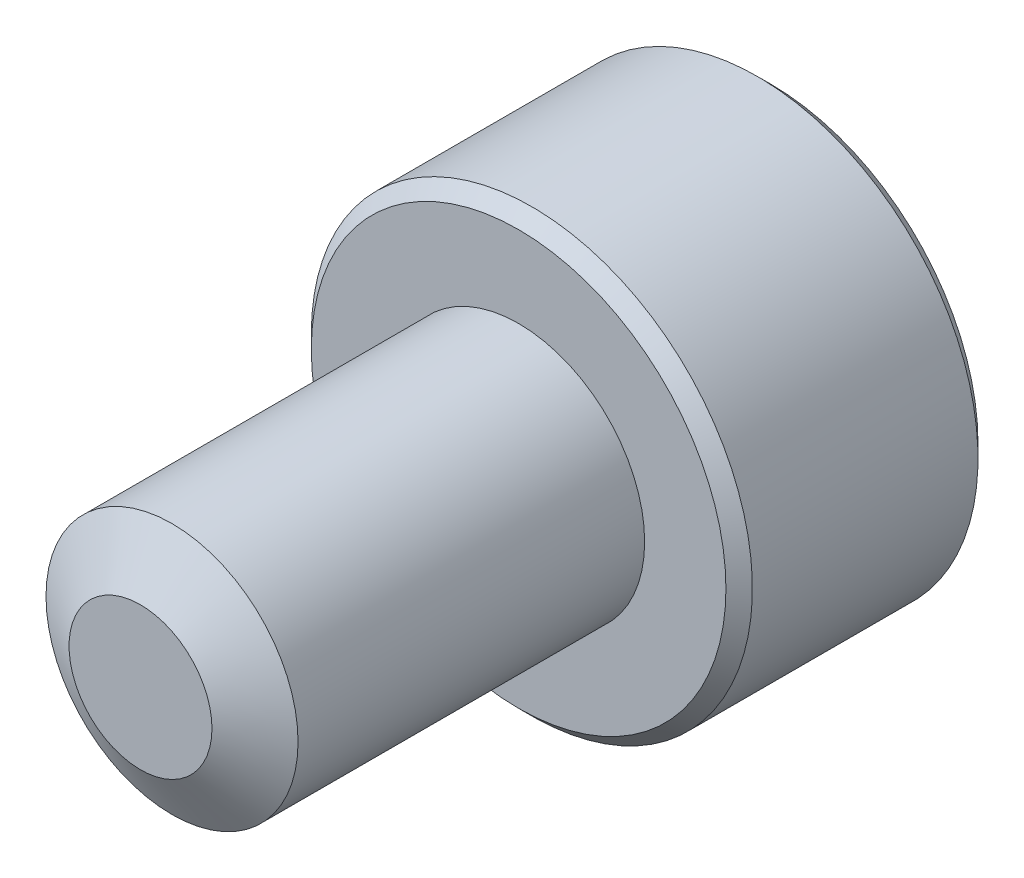
ISO-10303-21;
HEADER;
FILE_DESCRIPTION(('STEP AP214'),'2;1');
FILE_NAME('part.step','',(''),(''),'','','');
FILE_SCHEMA(('AUTOMOTIVE_DESIGN { 1 0 10303 214 1 1 1 1 }'));
ENDSEC;
DATA;
#1=APPLICATION_CONTEXT('core data for automotive mechanical design processes');
#2=APPLICATION_PROTOCOL_DEFINITION('international standard','automotive_design',2000,#1);
#3=PRODUCT_CONTEXT('',#1,'mechanical');
#4=PRODUCT('Part','Part','',(#3));
#5=PRODUCT_RELATED_PRODUCT_CATEGORY('part','',(#4));
#6=PRODUCT_DEFINITION_FORMATION('','',#4);
#7=PRODUCT_DEFINITION_CONTEXT('part definition',#1,'design');
#8=PRODUCT_DEFINITION('design','',#6,#7);
#9=PRODUCT_DEFINITION_SHAPE('','',#8);
#10=(LENGTH_UNIT() NAMED_UNIT(*) SI_UNIT(.MILLI.,.METRE.));
#11=(NAMED_UNIT(*) PLANE_ANGLE_UNIT() SI_UNIT($,.RADIAN.));
#12=(NAMED_UNIT(*) SI_UNIT($,.STERADIAN.) SOLID_ANGLE_UNIT());
#13=UNCERTAINTY_MEASURE_WITH_UNIT(LENGTH_MEASURE(1.E-05),#10,'distance_accuracy_value','');
#14=(GEOMETRIC_REPRESENTATION_CONTEXT(3) GLOBAL_UNCERTAINTY_ASSIGNED_CONTEXT((#13)) GLOBAL_UNIT_ASSIGNED_CONTEXT((#10,
#11,#12)) REPRESENTATION_CONTEXT('',''));
#15=CARTESIAN_POINT('',(0.,0.,0.));
#16=DIRECTION('',(0.,0.,1.));
#17=DIRECTION('',(1.,0.,0.));
#18=AXIS2_PLACEMENT_3D('',#15,#16,#17);
#19=CARTESIAN_POINT('',(0.,0.,-6.));
#20=DIRECTION('',(0.,0.,1.));
#21=DIRECTION('',(1.,0.,0.));
#22=AXIS2_PLACEMENT_3D('',#19,#20,#21);
#23=CYLINDRICAL_SURFACE('',#22,2.);
#24=CARTESIAN_POINT('',(0.,0.,-0.5));
#25=DIRECTION('',(0.,0.,1.));
#26=DIRECTION('',(1.,0.,0.));
#27=AXIS2_PLACEMENT_3D('',#24,#25,#26);
#28=CIRCLE('',#27,2.);
#29=CARTESIAN_POINT('',(2.,0.,-0.5));
#30=VERTEX_POINT('',#29);
#31=EDGE_CURVE('E11',#30,#30,#28,.F.);
#32=ORIENTED_EDGE('',*,*,#31,.T.);
#33=EDGE_LOOP('',(#32));
#34=FACE_BOUND('',#33,.T.);
#35=CARTESIAN_POINT('',(0.,0.,-6.));
#36=DIRECTION('',(0.,0.,1.));
#37=DIRECTION('',(1.,0.,0.));
#38=AXIS2_PLACEMENT_3D('',#35,#36,#37);
#39=CIRCLE('',#38,2.);
#40=CARTESIAN_POINT('',(2.,0.,-6.));
#41=VERTEX_POINT('',#40);
#42=EDGE_CURVE('E118',#41,#41,#39,.T.);
#43=ORIENTED_EDGE('',*,*,#42,.T.);
#44=EDGE_LOOP('',(#43));
#45=FACE_BOUND('',#44,.T.);
#46=ADVANCED_FACE('F41',(#34,#45),#23,.T.);
#47=CARTESIAN_POINT('',(0.,0.,-10.));
#48=DIRECTION('',(0.,0.,1.));
#49=DIRECTION('',(1.,0.,0.));
#50=AXIS2_PLACEMENT_3D('',#47,#48,#49);
#51=CYLINDRICAL_SURFACE('',#50,3.5);
#52=CARTESIAN_POINT('',(0.,0.,-9.79));
#53=DIRECTION('',(0.,0.,-1.));
#54=DIRECTION('',(-1.,0.,0.));
#55=AXIS2_PLACEMENT_3D('',#52,#53,#54);
#56=CIRCLE('',#55,3.5);
#57=CARTESIAN_POINT('',(-3.5,0.,-9.79));
#58=VERTEX_POINT('',#57);
#59=EDGE_CURVE('E190',#58,#58,#56,.F.);
#60=ORIENTED_EDGE('',*,*,#59,.T.);
#61=EDGE_LOOP('',(#60));
#62=FACE_BOUND('',#61,.T.);
#63=CARTESIAN_POINT('',(0.,0.,-6.21));
#64=DIRECTION('',(0.,0.,-1.));
#65=DIRECTION('',(-1.,0.,0.));
#66=AXIS2_PLACEMENT_3D('',#63,#64,#65);
#67=CIRCLE('',#66,3.5);
#68=CARTESIAN_POINT('',(-3.5,0.,-6.21));
#69=VERTEX_POINT('',#68);
#70=EDGE_CURVE('E186',#69,#69,#67,.T.);
#71=ORIENTED_EDGE('',*,*,#70,.T.);
#72=EDGE_LOOP('',(#71));
#73=FACE_BOUND('',#72,.T.);
#74=ADVANCED_FACE('F212',(#62,#73),#51,.T.);
#75=CARTESIAN_POINT('',(0.,0.,-10.));
#76=DIRECTION('',(0.,0.,-1.));
#77=DIRECTION('',(-1.,0.,0.));
#78=AXIS2_PLACEMENT_3D('',#75,#76,#77);
#79=PLANE('',#78);
#80=CARTESIAN_POINT('',(0.,0.,-10.));
#81=DIRECTION('',(0.,0.,-1.));
#82=DIRECTION('',(-1.,0.,0.));
#83=AXIS2_PLACEMENT_3D('',#80,#81,#82);
#84=CIRCLE('',#83,3.29);
#85=CARTESIAN_POINT('',(-3.29,0.,-10.));
#86=VERTEX_POINT('',#85);
#87=EDGE_CURVE('E117',#86,#86,#84,.T.);
#88=ORIENTED_EDGE('',*,*,#87,.T.);
#89=EDGE_LOOP('',(#88));
#90=FACE_BOUND('',#89,.T.);
#91=CARTESIAN_POINT('',(0.,0.,-10.));
#92=DIRECTION('',(0.,0.,-1.));
#93=DIRECTION('',(-1.,0.,0.));
#94=AXIS2_PLACEMENT_3D('',#91,#92,#93);
#95=CIRCLE('',#94,1.73205080756888);
#96=CARTESIAN_POINT('',(-1.5,0.866025403784442,-10.));
#97=VERTEX_POINT('',#96);
#98=CARTESIAN_POINT('',(0.,1.73205080756888,-10.));
#99=VERTEX_POINT('',#98);
#100=EDGE_CURVE('E96',#97,#99,#95,.T.);
#101=ORIENTED_EDGE('',*,*,#100,.F.);
#102=CARTESIAN_POINT('',(-1.5,-0.86602540378444,-10.));
#103=VERTEX_POINT('',#102);
#104=EDGE_CURVE('E56',#103,#97,#95,.T.);
#105=ORIENTED_EDGE('',*,*,#104,.F.);
#106=CARTESIAN_POINT('',(0.,-1.73205080756888,-10.));
#107=VERTEX_POINT('',#106);
#108=EDGE_CURVE('E313',#107,#103,#95,.T.);
#109=ORIENTED_EDGE('',*,*,#108,.F.);
#110=CARTESIAN_POINT('',(1.5,-0.866025403784441,-10.));
#111=VERTEX_POINT('',#110);
#112=EDGE_CURVE('E63',#111,#107,#95,.T.);
#113=ORIENTED_EDGE('',*,*,#112,.F.);
#114=CARTESIAN_POINT('',(1.5,0.866025403784441,-10.));
#115=VERTEX_POINT('',#114);
#116=EDGE_CURVE('E141',#115,#111,#95,.T.);
#117=ORIENTED_EDGE('',*,*,#116,.F.);
#118=EDGE_CURVE('E106',#99,#115,#95,.T.);
#119=ORIENTED_EDGE('',*,*,#118,.F.);
#120=EDGE_LOOP('',(#101,#105,#109,#113,#117,#119));
#121=FACE_BOUND('',#120,.T.);
#122=ADVANCED_FACE('F140',(#90,#121),#79,.T.);
#123=CARTESIAN_POINT('',(0.,0.,-6.));
#124=DIRECTION('',(0.,0.,-1.));
#125=DIRECTION('',(-1.,0.,0.));
#126=AXIS2_PLACEMENT_3D('',#123,#124,#125);
#127=PLANE('',#126);
#128=CARTESIAN_POINT('',(0.,0.,-6.));
#129=DIRECTION('',(0.,0.,-1.));
#130=DIRECTION('',(-1.,0.,0.));
#131=AXIS2_PLACEMENT_3D('',#128,#129,#130);
#132=CIRCLE('',#131,3.29);
#133=CARTESIAN_POINT('',(-3.29,0.,-6.));
#134=VERTEX_POINT('',#133);
#135=EDGE_CURVE('E194',#134,#134,#132,.F.);
#136=ORIENTED_EDGE('',*,*,#135,.T.);
#137=EDGE_LOOP('',(#136));
#138=FACE_BOUND('',#137,.T.);
#139=ORIENTED_EDGE('',*,*,#42,.F.);
#140=EDGE_LOOP('',(#139));
#141=FACE_BOUND('',#140,.T.);
#142=ADVANCED_FACE('F234',(#138,#141),#127,.F.);
#143=CARTESIAN_POINT('',(0.,0.,-10.));
#144=DIRECTION('',(0.,0.,-1.));
#145=DIRECTION('',(-1.,0.,0.));
#146=AXIS2_PLACEMENT_3D('',#143,#144,#145);
#147=CONICAL_SURFACE('',#146,1.73205080756888,0.78539816339745);
#148=ORIENTED_EDGE('',*,*,#118,.T.);
#149=CARTESIAN_POINT('',(-0.000199999999998815,1.73216627762271,-10.0001154816001));
#150=CARTESIAN_POINT('',(0.0513677907370769,1.70239359975915,-9.97036547606733));
#151=CARTESIAN_POINT('',(0.103797917665202,1.67212305186355,-9.94236248391031));
#152=CARTESIAN_POINT('',(0.210709034055598,1.61039789003619,-9.89108923044014));
#153=CARTESIAN_POINT('',(0.265200195814662,1.57893740312614,-9.86784750504437));
#154=CARTESIAN_POINT('',(0.375079081357249,1.51549879897987,-9.82803372899222));
#155=CARTESIAN_POINT('',(0.4304388090952,1.4835368452681,-9.8113615856709));
#156=CARTESIAN_POINT('',(0.542377257477151,1.41890915196211,-9.78567445681811));
#157=CARTESIAN_POINT('',(0.598952556553009,1.38624538781118,-9.77664029047887));
#158=CARTESIAN_POINT('',(0.696455389516441,1.329952100953,-9.76848908122685));
#159=CARTESIAN_POINT('',(0.737256908280466,1.30639533311124,-9.76728225298922));
#160=CARTESIAN_POINT('',(0.818787969615858,1.25932335290193,-9.76931405716227));
#161=CARTESIAN_POINT('',(0.85951749431463,1.23580815085313,-9.77255367074831));
#162=CARTESIAN_POINT('',(0.940584402163416,1.18900414978427,-9.78329198598196));
#163=CARTESIAN_POINT('',(0.980921384598288,1.1657155821172,-9.79079465301873));
#164=CARTESIAN_POINT('',(1.06091833691403,1.11952932016335,-9.80965161192829));
#165=CARTESIAN_POINT('',(1.10057800851621,1.09663179808786,-9.82100755701859));
#166=CARTESIAN_POINT('',(1.20216313477448,1.03798159809699,-9.85472164759267));
#167=CARTESIAN_POINT('',(1.26345855370969,1.00259267147465,-9.87962184909337));
#168=CARTESIAN_POINT('',(1.35358562846331,0.950557780604376,-9.92165665327158));
#169=CARTESIAN_POINT('',(1.38328513990772,0.933410759677149,-9.9364251535591));
#170=CARTESIAN_POINT('',(1.44213790138375,0.899432101996409,-9.96731056594017));
#171=CARTESIAN_POINT('',(1.47129140422064,0.882600319285711,-9.98342683412171));
#172=CARTESIAN_POINT('',(1.5002,0.865909933730602,-10.0001154816001));
#173=B_SPLINE_CURVE_WITH_KNOTS('',3,(#149,#150,#151,#152,#153,#154,#155,#156,#157,#158,#159,
#160,#161,#162,#163,#164,#165,#166,#167,#168,#169,#170,#171,#172),.UNSPECIFIED.,.F.,.F.,(4,2,2,
2,2,2,2,2,2,2,2,4),(0.,0.199829143693305,0.400822987382388,0.598623720538179,0.795926240188887,
0.937113067959879,1.07833105577193,1.21968061668222,1.36109089931054,1.58570969637565,
1.69770705470963,1.80965120737193),.UNSPECIFIED.);
#174=EDGE_CURVE('E111',#99,#115,#173,.T.);
#175=ORIENTED_EDGE('',*,*,#174,.F.);
#176=EDGE_LOOP('',(#148,#175));
#177=FACE_BOUND('',#176,.T.);
#178=ADVANCED_FACE('F112',(#177),#147,.F.);
#179=ORIENTED_EDGE('',*,*,#116,.T.);
#180=CARTESIAN_POINT('',(1.5,-1.72720812969692,-10.5555785162708));
#181=CARTESIAN_POINT('',(1.5,-1.68515175699268,-10.5238299078574));
#182=CARTESIAN_POINT('',(1.5,-1.64286104748673,-10.4923925938074));
#183=CARTESIAN_POINT('',(1.5,-1.55771581035942,-10.4302690875564));
#184=CARTESIAN_POINT('',(1.5,-1.51486114386668,-10.3995830858922));
#185=CARTESIAN_POINT('',(1.5,-1.3846813415127,-10.3084071924272));
#186=CARTESIAN_POINT('',(1.5,-1.29637976071653,-10.2492883434268));
#187=CARTESIAN_POINT('',(1.5,-1.11121478730467,-10.1332309963165));
#188=CARTESIAN_POINT('',(1.5,-1.01415038238167,-10.076609558733));
#189=CARTESIAN_POINT('',(1.5,-0.815173408897605,-9.97303688126565));
#190=CARTESIAN_POINT('',(1.5,-0.713278669253285,-9.92605304154167));
#191=CARTESIAN_POINT('',(1.5,-0.560333774943111,-9.86857266843083));
#192=CARTESIAN_POINT('',(1.5,-0.511547982948042,-9.85207538775725));
#193=CARTESIAN_POINT('',(1.5,-0.412798620136866,-9.822997512927));
#194=CARTESIAN_POINT('',(1.5,-0.362834968437562,-9.81041718859402));
#195=CARTESIAN_POINT('',(1.5,-0.262863235444982,-9.79003619414677));
#196=CARTESIAN_POINT('',(1.5,-0.212872113808023,-9.78215363274598));
#197=CARTESIAN_POINT('',(1.5,-0.112355243569546,-9.771322063969));
#198=CARTESIAN_POINT('',(1.5,-0.0618295883726282,-9.76837220852435));
#199=CARTESIAN_POINT('',(1.5,0.0374291733323835,-9.76762485772485));
#200=CARTESIAN_POINT('',(1.5,0.0861609672002982,-9.76964473355807));
#201=CARTESIAN_POINT('',(1.5,0.183206937768826,-9.77832255289676));
#202=CARTESIAN_POINT('',(1.5,0.231521073438268,-9.78498094696845));
#203=CARTESIAN_POINT('',(1.5,0.328199853425435,-9.80268524412257));
#204=CARTESIAN_POINT('',(1.5,0.376550616310327,-9.81380581125704));
#205=CARTESIAN_POINT('',(1.5,0.472195697125597,-9.83984341404871));
#206=CARTESIAN_POINT('',(1.5,0.519490103092739,-9.85476013204093));
#207=CARTESIAN_POINT('',(1.5,0.668391282696624,-9.90733522359607));
#208=CARTESIAN_POINT('',(1.5,0.767878709508551,-9.95098128747197));
#209=CARTESIAN_POINT('',(1.5,0.962179866690723,-10.0480229945931));
#210=CARTESIAN_POINT('',(1.5,1.05697519961444,-10.1014536650895));
#211=CARTESIAN_POINT('',(1.5,1.23814273533383,-10.2116858520046));
#212=CARTESIAN_POINT('',(1.5,1.32469942181289,-10.2681879206986));
#213=CARTESIAN_POINT('',(1.5,1.45222331290673,-10.3555343015787));
#214=CARTESIAN_POINT('',(1.5,1.49418091978755,-10.38495775868));
#215=CARTESIAN_POINT('',(1.5,1.57752272931476,-10.4445828218305));
#216=CARTESIAN_POINT('',(1.5,1.61890708647354,-10.4747842116644));
#217=CARTESIAN_POINT('',(1.5,1.66005278019494,-10.5053081786095));
#218=B_SPLINE_CURVE_WITH_KNOTS('',3,(#180,#181,#182,#183,#184,#185,#186,#187,#188,#189,#190,
#191,#192,#193,#194,#195,#196,#197,#198,#199,#200,#201,#202,#203,#204,#205,#206,#207,#208,#209,
#210,#211,#212,#213,#214,#215,#216,#217),.UNSPECIFIED.,.F.,.F.,(4,2,2,2,2,2,2,2,2,2,2,2,2,2,2,2,
2,2,4),(0.,0.158079548982669,0.316198780993942,0.634850417346958,0.971690311361509,
1.30737131660667,1.46173961127089,1.61611853740677,1.76772101421409,1.91929742368538,
2.065387412096,2.21149159305544,2.36014984633872,2.50879566386709,2.83376031422673,
3.15991186985652,3.46985601802197,3.62358896039973,3.7772796264207),.UNSPECIFIED.);
#219=EDGE_CURVE('E105',#115,#111,#218,.F.);
#220=ORIENTED_EDGE('',*,*,#219,.F.);
#221=EDGE_LOOP('',(#179,#220));
#222=FACE_BOUND('',#221,.T.);
#223=ADVANCED_FACE('F322',(#222),#147,.F.);
#224=ORIENTED_EDGE('',*,*,#112,.T.);
#225=CARTESIAN_POINT('',(1.5002,-0.865909933730601,-10.0001154816001));
#226=CARTESIAN_POINT('',(1.44863220926292,-0.895682611594166,-9.97036547606733));
#227=CARTESIAN_POINT('',(1.3962020823348,-0.925953159489765,-9.94236248391031));
#228=CARTESIAN_POINT('',(1.2892909659444,-0.987678321317123,-9.89108923044014));
#229=CARTESIAN_POINT('',(1.23479980418534,-1.01913880822717,-9.86784750504437));
#230=CARTESIAN_POINT('',(1.12492091864275,-1.08257741237344,-9.82803372899222));
#231=CARTESIAN_POINT('',(1.0695611909048,-1.11453936608521,-9.81136158567089));
#232=CARTESIAN_POINT('',(0.957622742522848,-1.1791670593912,-9.7856744568181));
#233=CARTESIAN_POINT('',(0.90104744344699,-1.21183082354213,-9.77664029047887));
#234=CARTESIAN_POINT('',(0.803544610483558,-1.26812411040032,-9.76848908122685));
#235=CARTESIAN_POINT('',(0.762743091719533,-1.29168087824208,-9.76728225298922));
#236=CARTESIAN_POINT('',(0.681212030384141,-1.33875285845138,-9.76931405716227));
#237=CARTESIAN_POINT('',(0.640482505685369,-1.36226806050018,-9.77255367074831));
#238=CARTESIAN_POINT('',(0.559415597836583,-1.40907206156905,-9.78329198598196));
#239=CARTESIAN_POINT('',(0.519078615401711,-1.43236062923612,-9.79079465301873));
#240=CARTESIAN_POINT('',(0.439081663085969,-1.47854689118996,-9.80965161192829));
#241=CARTESIAN_POINT('',(0.399421991483792,-1.50144441326545,-9.82100755701859));
#242=CARTESIAN_POINT('',(0.297836865225514,-1.56009461325633,-9.85472164759267));
#243=CARTESIAN_POINT('',(0.23654144629031,-1.59548353987866,-9.87962184909337));
#244=CARTESIAN_POINT('',(0.146414371536685,-1.64751843074894,-9.92165665327158));
#245=CARTESIAN_POINT('',(0.116714860092281,-1.66466545167617,-9.9364251535591));
#246=CARTESIAN_POINT('',(0.0578620986162475,-1.69864410935691,-9.96731056594017));
#247=CARTESIAN_POINT('',(0.0287085957793614,-1.71547589206761,-9.98342683412171));
#248=CARTESIAN_POINT('',(-0.000200000000001163,-1.73216627762271,-10.0001154816001));
#249=B_SPLINE_CURVE_WITH_KNOTS('',3,(#225,#226,#227,#228,#229,#230,#231,#232,#233,#234,#235,
#236,#237,#238,#239,#240,#241,#242,#243,#244,#245,#246,#247,#248),.UNSPECIFIED.,.F.,.F.,(4,2,2,
2,2,2,2,2,2,2,2,4),(0.,0.199829143693305,0.400822987382388,0.59862372053818,0.795926240188888,
0.93711306795988,1.07833105577193,1.21968061668222,1.36109089931054,1.58570969637565,
1.69770705470964,1.80965120737194),.UNSPECIFIED.);
#250=EDGE_CURVE('E154',#111,#107,#249,.T.);
#251=ORIENTED_EDGE('',*,*,#250,.F.);
#252=EDGE_LOOP('',(#224,#251));
#253=FACE_BOUND('',#252,.T.);
#254=ADVANCED_FACE('F320',(#253),#147,.F.);
#255=ORIENTED_EDGE('',*,*,#108,.T.);
#256=CARTESIAN_POINT('',(0.000199999999999467,-1.73216627762271,-10.0001154816001));
#257=CARTESIAN_POINT('',(-0.0513677907370766,-1.70239359975915,-9.97036547606733));
#258=CARTESIAN_POINT('',(-0.103797917665202,-1.67212305186355,-9.94236248391031));
#259=CARTESIAN_POINT('',(-0.210709034055597,-1.61039789003619,-9.89108923044014));
#260=CARTESIAN_POINT('',(-0.265200195814661,-1.57893740312614,-9.86784750504437));
#261=CARTESIAN_POINT('',(-0.375079081357249,-1.51549879897987,-9.82803372899222));
#262=CARTESIAN_POINT('',(-0.4304388090952,-1.4835368452681,-9.8113615856709));
#263=CARTESIAN_POINT('',(-0.542377257477151,-1.41890915196211,-9.78567445681811));
#264=CARTESIAN_POINT('',(-0.598952556553009,-1.38624538781118,-9.77664029047887));
#265=CARTESIAN_POINT('',(-0.696455389516441,-1.32995210095299,-9.76848908122685));
#266=CARTESIAN_POINT('',(-0.737256908280467,-1.30639533311124,-9.76728225298922));
#267=CARTESIAN_POINT('',(-0.818787969615859,-1.25932335290193,-9.76931405716227));
#268=CARTESIAN_POINT('',(-0.85951749431463,-1.23580815085313,-9.77255367074831));
#269=CARTESIAN_POINT('',(-0.940584402163416,-1.18900414978427,-9.78329198598196));
#270=CARTESIAN_POINT('',(-0.980921384598289,-1.1657155821172,-9.79079465301873));
#271=CARTESIAN_POINT('',(-1.06091833691403,-1.11952932016335,-9.80965161192829));
#272=CARTESIAN_POINT('',(-1.10057800851621,-1.09663179808786,-9.82100755701859));
#273=CARTESIAN_POINT('',(-1.20216313477449,-1.03798159809698,-9.85472164759267));
#274=CARTESIAN_POINT('',(-1.26345855370969,-1.00259267147465,-9.87962184909337));
#275=CARTESIAN_POINT('',(-1.35358562846331,-0.950557780604376,-9.92165665327158));
#276=CARTESIAN_POINT('',(-1.38328513990772,-0.933410759677149,-9.9364251535591));
#277=CARTESIAN_POINT('',(-1.44213790138375,-0.899432101996408,-9.96731056594017));
#278=CARTESIAN_POINT('',(-1.47129140422064,-0.882600319285712,-9.98342683412171));
#279=CARTESIAN_POINT('',(-1.5002,-0.865909933730603,-10.0001154816001));
#280=B_SPLINE_CURVE_WITH_KNOTS('',3,(#256,#257,#258,#259,#260,#261,#262,#263,#264,#265,#266,
#267,#268,#269,#270,#271,#272,#273,#274,#275,#276,#277,#278,#279),.UNSPECIFIED.,.F.,.F.,(4,2,2,
2,2,2,2,2,2,2,2,4),(0.,0.199829143693305,0.400822987382389,0.598623720538181,0.795926240188889,
0.937113067959881,1.07833105577193,1.21968061668222,1.36109089931055,1.58570969637565,
1.69770705470963,1.80965120737193),.UNSPECIFIED.);
#281=EDGE_CURVE('E285',#107,#103,#280,.T.);
#282=ORIENTED_EDGE('',*,*,#281,.F.);
#283=EDGE_LOOP('',(#255,#282));
#284=FACE_BOUND('',#283,.T.);
#285=ADVANCED_FACE('F318',(#284),#147,.F.);
#286=ORIENTED_EDGE('',*,*,#104,.T.);
#287=CARTESIAN_POINT('',(-1.5,-1.72720812969693,-10.5555785162708));
#288=CARTESIAN_POINT('',(-1.5,-1.68515175699268,-10.5238299078574));
#289=CARTESIAN_POINT('',(-1.5,-1.64286104748674,-10.4923925938074));
#290=CARTESIAN_POINT('',(-1.5,-1.55771581035942,-10.4302690875564));
#291=CARTESIAN_POINT('',(-1.5,-1.51486114386669,-10.3995830858922));
#292=CARTESIAN_POINT('',(-1.5,-1.38468134151271,-10.3084071924272));
#293=CARTESIAN_POINT('',(-1.5,-1.29637976071654,-10.2492883434268));
#294=CARTESIAN_POINT('',(-1.5,-1.11121478730467,-10.1332309963165));
#295=CARTESIAN_POINT('',(-1.5,-1.01415038238167,-10.076609558733));
#296=CARTESIAN_POINT('',(-1.5,-0.815173408897606,-9.97303688126565));
#297=CARTESIAN_POINT('',(-1.5,-0.713278669253286,-9.92605304154167));
#298=CARTESIAN_POINT('',(-1.5,-0.560333774943113,-9.86857266843083));
#299=CARTESIAN_POINT('',(-1.5,-0.511547982948043,-9.85207538775725));
#300=CARTESIAN_POINT('',(-1.5,-0.412798620136868,-9.822997512927));
#301=CARTESIAN_POINT('',(-1.5,-0.362834968437564,-9.81041718859402));
#302=CARTESIAN_POINT('',(-1.5,-0.262863235444984,-9.79003619414677));
#303=CARTESIAN_POINT('',(-1.5,-0.212872113808024,-9.78215363274598));
#304=CARTESIAN_POINT('',(-1.5,-0.112355243569547,-9.771322063969));
#305=CARTESIAN_POINT('',(-1.5,-0.0618295883726296,-9.76837220852435));
#306=CARTESIAN_POINT('',(-1.5,0.0374291733323826,-9.76762485772485));
#307=CARTESIAN_POINT('',(-1.5,0.0861609672002977,-9.76964473355807));
#308=CARTESIAN_POINT('',(-1.5,0.183206937768826,-9.77832255289676));
#309=CARTESIAN_POINT('',(-1.5,0.231521073438268,-9.78498094696845));
#310=CARTESIAN_POINT('',(-1.5,0.328199853425435,-9.80268524412257));
#311=CARTESIAN_POINT('',(-1.5,0.376550616310327,-9.81380581125704));
#312=CARTESIAN_POINT('',(-1.5,0.472195697125598,-9.83984341404871));
#313=CARTESIAN_POINT('',(-1.5,0.51949010309274,-9.85476013204093));
#314=CARTESIAN_POINT('',(-1.5,0.668391282696624,-9.90733522359607));
#315=CARTESIAN_POINT('',(-1.5,0.767878709508552,-9.95098128747197));
#316=CARTESIAN_POINT('',(-1.5,0.962179866690723,-10.0480229945931));
#317=CARTESIAN_POINT('',(-1.5,1.05697519961444,-10.1014536650895));
#318=CARTESIAN_POINT('',(-1.5,1.23814273533382,-10.2116858520046));
#319=CARTESIAN_POINT('',(-1.5,1.32469942181289,-10.2681879206986));
#320=CARTESIAN_POINT('',(-1.5,1.45222331290673,-10.3555343015787));
#321=CARTESIAN_POINT('',(-1.5,1.49418091978755,-10.38495775868));
#322=CARTESIAN_POINT('',(-1.5,1.57752272931476,-10.4445828218305));
#323=CARTESIAN_POINT('',(-1.5,1.61890708647354,-10.4747842116644));
#324=CARTESIAN_POINT('',(-1.5,1.66005278019494,-10.5053081786095));
#325=B_SPLINE_CURVE_WITH_KNOTS('',3,(#287,#288,#289,#290,#291,#292,#293,#294,#295,#296,#297,
#298,#299,#300,#301,#302,#303,#304,#305,#306,#307,#308,#309,#310,#311,#312,#313,#314,#315,#316,
#317,#318,#319,#320,#321,#322,#323,#324),.UNSPECIFIED.,.F.,.F.,(4,2,2,2,2,2,2,2,2,2,2,2,2,2,2,2,
2,2,4),(0.,0.15807954898267,0.316198780993944,0.634850417346961,0.971690311361516,
1.30737131660667,1.46173961127089,1.61611853740678,1.7677210142141,1.91929742368539,
2.06538741209601,2.21149159305545,2.36014984633873,2.5087956638671,2.83376031422674,
3.15991186985652,3.46985601802198,3.62358896039974,3.77727962642071),.UNSPECIFIED.);
#326=EDGE_CURVE('E129',#103,#97,#325,.T.);
#327=ORIENTED_EDGE('',*,*,#326,.F.);
#328=EDGE_LOOP('',(#286,#327));
#329=FACE_BOUND('',#328,.T.);
#330=ADVANCED_FACE('F327',(#329),#147,.F.);
#331=ORIENTED_EDGE('',*,*,#100,.T.);
#332=CARTESIAN_POINT('',(-1.5002,0.865909933730602,-10.0001154816001));
#333=CARTESIAN_POINT('',(-1.44863220926292,0.895682611594166,-9.97036547606733));
#334=CARTESIAN_POINT('',(-1.3962020823348,0.925953159489766,-9.94236248391031));
#335=CARTESIAN_POINT('',(-1.2892909659444,0.987678321317124,-9.89108923044014));
#336=CARTESIAN_POINT('',(-1.23479980418534,1.01913880822718,-9.86784750504437));
#337=CARTESIAN_POINT('',(-1.12492091864275,1.08257741237344,-9.82803372899222));
#338=CARTESIAN_POINT('',(-1.0695611909048,1.11453936608521,-9.81136158567089));
#339=CARTESIAN_POINT('',(-0.957622742522848,1.1791670593912,-9.7856744568181));
#340=CARTESIAN_POINT('',(-0.90104744344699,1.21183082354213,-9.77664029047887));
#341=CARTESIAN_POINT('',(-0.803544610483558,1.26812411040032,-9.76848908122685));
#342=CARTESIAN_POINT('',(-0.762743091719532,1.29168087824208,-9.76728225298922));
#343=CARTESIAN_POINT('',(-0.68121203038414,1.33875285845138,-9.76931405716227));
#344=CARTESIAN_POINT('',(-0.640482505685369,1.36226806050018,-9.77255367074831));
#345=CARTESIAN_POINT('',(-0.559415597836583,1.40907206156905,-9.78329198598196));
#346=CARTESIAN_POINT('',(-0.519078615401711,1.43236062923612,-9.79079465301873));
#347=CARTESIAN_POINT('',(-0.439081663085968,1.47854689118996,-9.80965161192829));
#348=CARTESIAN_POINT('',(-0.399421991483791,1.50144441326545,-9.82100755701859));
#349=CARTESIAN_POINT('',(-0.297836865225514,1.56009461325633,-9.85472164759267));
#350=CARTESIAN_POINT('',(-0.23654144629031,1.59548353987866,-9.87962184909337));
#351=CARTESIAN_POINT('',(-0.146414371536685,1.64751843074894,-9.92165665327158));
#352=CARTESIAN_POINT('',(-0.116714860092281,1.66466545167617,-9.9364251535591));
#353=CARTESIAN_POINT('',(-0.0578620986162474,1.69864410935691,-9.96731056594017));
#354=CARTESIAN_POINT('',(-0.0287085957793612,1.71547589206761,-9.98342683412171));
#355=CARTESIAN_POINT('',(0.000200000000001217,1.73216627762271,-10.0001154816001));
#356=B_SPLINE_CURVE_WITH_KNOTS('',3,(#332,#333,#334,#335,#336,#337,#338,#339,#340,#341,#342,
#343,#344,#345,#346,#347,#348,#349,#350,#351,#352,#353,#354,#355),.UNSPECIFIED.,.F.,.F.,(4,2,2,
2,2,2,2,2,2,2,2,4),(0.,0.199829143693304,0.400822987382388,0.59862372053818,0.795926240188888,
0.93711306795988,1.07833105577193,1.21968061668222,1.36109089931054,1.58570969637565,
1.69770705470963,1.80965120737194),.UNSPECIFIED.);
#357=EDGE_CURVE('E100',#97,#99,#356,.T.);
#358=ORIENTED_EDGE('',*,*,#357,.F.);
#359=EDGE_LOOP('',(#331,#358));
#360=FACE_BOUND('',#359,.T.);
#361=ADVANCED_FACE('F98',(#360),#147,.F.);
#362=CARTESIAN_POINT('',(1.5,2.59807621135331,-7.75));
#363=DIRECTION('',(0.,0.,-1.));
#364=DIRECTION('',(-1.,0.,0.));
#365=AXIS2_PLACEMENT_3D('',#362,#363,#364);
#366=PLANE('',#365);
#367=DIRECTION('',(0.866025403784439,0.5,0.));
#368=VECTOR('',#367,1.);
#369=CARTESIAN_POINT('',(-1.5,0.86602540378444,-7.75));
#370=LINE('',#369,#368);
#371=CARTESIAN_POINT('',(-1.5,0.86602540378444,-7.75));
#372=VERTEX_POINT('',#371);
#373=CARTESIAN_POINT('',(0.,1.73205080756888,-7.75));
#374=VERTEX_POINT('',#373);
#375=EDGE_CURVE('E128',#372,#374,#370,.T.);
#376=ORIENTED_EDGE('',*,*,#375,.T.);
#377=DIRECTION('',(0.866025403784439,-0.5,0.));
#378=VECTOR('',#377,1.);
#379=CARTESIAN_POINT('',(0.,1.73205080756888,-7.75));
#380=LINE('',#379,#378);
#381=CARTESIAN_POINT('',(1.5,0.86602540378444,-7.75));
#382=VERTEX_POINT('',#381);
#383=EDGE_CURVE('E133',#374,#382,#380,.T.);
#384=ORIENTED_EDGE('',*,*,#383,.T.);
#385=DIRECTION('',(0.,-1.,0.));
#386=VECTOR('',#385,1.);
#387=CARTESIAN_POINT('',(1.5,0.86602540378444,-7.75));
#388=LINE('',#387,#386);
#389=CARTESIAN_POINT('',(1.5,-0.866025403784439,-7.75));
#390=VERTEX_POINT('',#389);
#391=EDGE_CURVE('E260',#382,#390,#388,.T.);
#392=ORIENTED_EDGE('',*,*,#391,.T.);
#393=DIRECTION('',(-0.866025403784439,-0.5,0.));
#394=VECTOR('',#393,1.);
#395=CARTESIAN_POINT('',(1.5,-0.866025403784439,-7.75));
#396=LINE('',#395,#394);
#397=CARTESIAN_POINT('',(0.,-1.73205080756888,-7.75));
#398=VERTEX_POINT('',#397);
#399=EDGE_CURVE('E265',#390,#398,#396,.T.);
#400=ORIENTED_EDGE('',*,*,#399,.T.);
#401=DIRECTION('',(-0.866025403784439,0.5,0.));
#402=VECTOR('',#401,1.);
#403=CARTESIAN_POINT('',(0.,-1.73205080756888,-7.75));
#404=LINE('',#403,#402);
#405=CARTESIAN_POINT('',(-1.5,-0.86602540378444,-7.75));
#406=VERTEX_POINT('',#405);
#407=EDGE_CURVE('E274',#398,#406,#404,.T.);
#408=ORIENTED_EDGE('',*,*,#407,.T.);
#409=DIRECTION('',(0.,1.,0.));
#410=VECTOR('',#409,1.);
#411=CARTESIAN_POINT('',(-1.5,-0.86602540378444,-7.75));
#412=LINE('',#411,#410);
#413=EDGE_CURVE('E137',#406,#372,#412,.T.);
#414=ORIENTED_EDGE('',*,*,#413,.T.);
#415=EDGE_LOOP('',(#376,#384,#392,#400,#408,#414));
#416=FACE_BOUND('',#415,.T.);
#417=ADVANCED_FACE('F174',(#416),#366,.T.);
#418=CARTESIAN_POINT('',(0.,1.73205080756888,-7.75));
#419=DIRECTION('',(0.5,0.866025403784439,0.));
#420=DIRECTION('',(-0.866025403784439,0.5,0.));
#421=AXIS2_PLACEMENT_3D('',#418,#419,#420);
#422=PLANE('',#421);
#423=DIRECTION('',(0.,0.,-1.));
#424=VECTOR('',#423,1.);
#425=CARTESIAN_POINT('',(0.,1.73205080756888,-7.75));
#426=LINE('',#425,#424);
#427=EDGE_CURVE('E124',#374,#99,#426,.T.);
#428=ORIENTED_EDGE('',*,*,#427,.T.);
#429=ORIENTED_EDGE('',*,*,#174,.T.);
#430=DIRECTION('',(0.,0.,-1.));
#431=VECTOR('',#430,1.);
#432=CARTESIAN_POINT('',(1.5,0.86602540378444,-7.75));
#433=LINE('',#432,#431);
#434=EDGE_CURVE('E136',#382,#115,#433,.T.);
#435=ORIENTED_EDGE('',*,*,#434,.F.);
#436=ORIENTED_EDGE('',*,*,#383,.F.);
#437=EDGE_LOOP('',(#428,#429,#435,#436));
#438=FACE_BOUND('',#437,.T.);
#439=ADVANCED_FACE('F131',(#438),#422,.F.);
#440=CARTESIAN_POINT('',(1.5,0.86602540378444,-7.75));
#441=DIRECTION('',(1.,0.,0.));
#442=DIRECTION('',(0.,1.,0.));
#443=AXIS2_PLACEMENT_3D('',#440,#441,#442);
#444=PLANE('',#443);
#445=ORIENTED_EDGE('',*,*,#434,.T.);
#446=ORIENTED_EDGE('',*,*,#219,.T.);
#447=DIRECTION('',(0.,0.,-1.));
#448=VECTOR('',#447,1.);
#449=CARTESIAN_POINT('',(1.5,-0.866025403784439,-7.75));
#450=LINE('',#449,#448);
#451=EDGE_CURVE('E253',#390,#111,#450,.T.);
#452=ORIENTED_EDGE('',*,*,#451,.F.);
#453=ORIENTED_EDGE('',*,*,#391,.F.);
#454=EDGE_LOOP('',(#445,#446,#452,#453));
#455=FACE_BOUND('',#454,.T.);
#456=ADVANCED_FACE('F163',(#455),#444,.F.);
#457=CARTESIAN_POINT('',(1.5,-0.866025403784439,-7.75));
#458=DIRECTION('',(0.5,-0.866025403784439,0.));
#459=DIRECTION('',(0.866025403784439,0.5,0.));
#460=AXIS2_PLACEMENT_3D('',#457,#458,#459);
#461=PLANE('',#460);
#462=ORIENTED_EDGE('',*,*,#451,.T.);
#463=ORIENTED_EDGE('',*,*,#250,.T.);
#464=DIRECTION('',(0.,0.,-1.));
#465=VECTOR('',#464,1.);
#466=CARTESIAN_POINT('',(0.,-1.73205080756888,-7.75));
#467=LINE('',#466,#465);
#468=EDGE_CURVE('E245',#398,#107,#467,.T.);
#469=ORIENTED_EDGE('',*,*,#468,.F.);
#470=ORIENTED_EDGE('',*,*,#399,.F.);
#471=EDGE_LOOP('',(#462,#463,#469,#470));
#472=FACE_BOUND('',#471,.T.);
#473=ADVANCED_FACE('F167',(#472),#461,.F.);
#474=CARTESIAN_POINT('',(0.,-1.73205080756888,-7.75));
#475=DIRECTION('',(-0.5,-0.866025403784439,0.));
#476=DIRECTION('',(0.866025403784439,-0.5,0.));
#477=AXIS2_PLACEMENT_3D('',#474,#475,#476);
#478=PLANE('',#477);
#479=ORIENTED_EDGE('',*,*,#468,.T.);
#480=ORIENTED_EDGE('',*,*,#281,.T.);
#481=DIRECTION('',(0.,0.,-1.));
#482=VECTOR('',#481,1.);
#483=CARTESIAN_POINT('',(-1.5,-0.86602540378444,-7.75));
#484=LINE('',#483,#482);
#485=EDGE_CURVE('E242',#406,#103,#484,.T.);
#486=ORIENTED_EDGE('',*,*,#485,.F.);
#487=ORIENTED_EDGE('',*,*,#407,.F.);
#488=EDGE_LOOP('',(#479,#480,#486,#487));
#489=FACE_BOUND('',#488,.T.);
#490=ADVANCED_FACE('F303',(#489),#478,.F.);
#491=CARTESIAN_POINT('',(-1.5,-0.86602540378444,-7.75));
#492=DIRECTION('',(-1.,0.,0.));
#493=DIRECTION('',(0.,-1.,0.));
#494=AXIS2_PLACEMENT_3D('',#491,#492,#493);
#495=PLANE('',#494);
#496=ORIENTED_EDGE('',*,*,#485,.T.);
#497=ORIENTED_EDGE('',*,*,#326,.T.);
#498=DIRECTION('',(0.,0.,-1.));
#499=VECTOR('',#498,1.);
#500=CARTESIAN_POINT('',(-1.5,0.86602540378444,-7.75));
#501=LINE('',#500,#499);
#502=EDGE_CURVE('E126',#372,#97,#501,.T.);
#503=ORIENTED_EDGE('',*,*,#502,.F.);
#504=ORIENTED_EDGE('',*,*,#413,.F.);
#505=EDGE_LOOP('',(#496,#497,#503,#504));
#506=FACE_BOUND('',#505,.T.);
#507=ADVANCED_FACE('F281',(#506),#495,.F.);
#508=CARTESIAN_POINT('',(-1.5,0.86602540378444,-7.75));
#509=DIRECTION('',(-0.5,0.866025403784439,0.));
#510=DIRECTION('',(-0.866025403784439,-0.5,0.));
#511=AXIS2_PLACEMENT_3D('',#508,#509,#510);
#512=PLANE('',#511);
#513=ORIENTED_EDGE('',*,*,#502,.T.);
#514=ORIENTED_EDGE('',*,*,#357,.T.);
#515=ORIENTED_EDGE('',*,*,#427,.F.);
#516=ORIENTED_EDGE('',*,*,#375,.F.);
#517=EDGE_LOOP('',(#513,#514,#515,#516));
#518=FACE_BOUND('',#517,.T.);
#519=ADVANCED_FACE('F122',(#518),#512,.F.);
#520=CARTESIAN_POINT('',(0.,0.,-10.));
#521=DIRECTION('',(0.,0.,1.));
#522=DIRECTION('',(1.,0.,0.));
#523=AXIS2_PLACEMENT_3D('',#520,#521,#522);
#524=CONICAL_SURFACE('',#523,3.29,0.785398163397448);
#525=ORIENTED_EDGE('',*,*,#59,.F.);
#526=EDGE_LOOP('',(#525));
#527=FACE_BOUND('',#526,.T.);
#528=ORIENTED_EDGE('',*,*,#87,.F.);
#529=EDGE_LOOP('',(#528));
#530=FACE_BOUND('',#529,.T.);
#531=ADVANCED_FACE('F223',(#527,#530),#524,.T.);
#532=CARTESIAN_POINT('',(0.,0.,-6.21));
#533=DIRECTION('',(0.,0.,-1.));
#534=DIRECTION('',(-1.,0.,0.));
#535=AXIS2_PLACEMENT_3D('',#532,#533,#534);
#536=CONICAL_SURFACE('',#535,3.5,0.785398163397452);
#537=CARTESIAN_POINT('',(-3.29,0.,-6.));
#538=CARTESIAN_POINT('',(-3.2921875,0.,-6.0021875));
#539=CARTESIAN_POINT('',(-3.294375,0.,-6.004375));
#540=CARTESIAN_POINT('',(-3.29875,0.,-6.00875));
#541=CARTESIAN_POINT('',(-3.3009375,0.,-6.0109375));
#542=CARTESIAN_POINT('',(-3.3053125,0.,-6.0153125));
#543=CARTESIAN_POINT('',(-3.3075,0.,-6.0175));
#544=CARTESIAN_POINT('',(-3.311875,0.,-6.021875));
#545=CARTESIAN_POINT('',(-3.3140625,0.,-6.0240625));
#546=CARTESIAN_POINT('',(-3.3184375,0.,-6.0284375));
#547=CARTESIAN_POINT('',(-3.320625,0.,-6.030625));
#548=CARTESIAN_POINT('',(-3.325,0.,-6.035));
#549=CARTESIAN_POINT('',(-3.3271875,0.,-6.0371875));
#550=CARTESIAN_POINT('',(-3.3315625,0.,-6.0415625));
#551=CARTESIAN_POINT('',(-3.33375,0.,-6.04375));
#552=CARTESIAN_POINT('',(-3.338125,0.,-6.048125));
#553=CARTESIAN_POINT('',(-3.3403125,0.,-6.0503125));
#554=CARTESIAN_POINT('',(-3.3446875,0.,-6.0546875));
#555=CARTESIAN_POINT('',(-3.346875,0.,-6.056875));
#556=CARTESIAN_POINT('',(-3.35125,0.,-6.06125));
#557=CARTESIAN_POINT('',(-3.3534375,0.,-6.0634375));
#558=CARTESIAN_POINT('',(-3.3578125,0.,-6.0678125));
#559=CARTESIAN_POINT('',(-3.36,0.,-6.07));
#560=CARTESIAN_POINT('',(-3.364375,0.,-6.074375));
#561=CARTESIAN_POINT('',(-3.3665625,0.,-6.0765625));
#562=CARTESIAN_POINT('',(-3.3709375,0.,-6.0809375));
#563=CARTESIAN_POINT('',(-3.373125,0.,-6.083125));
#564=CARTESIAN_POINT('',(-3.3775,0.,-6.0875));
#565=CARTESIAN_POINT('',(-3.3796875,0.,-6.0896875));
#566=CARTESIAN_POINT('',(-3.3840625,0.,-6.0940625));
#567=CARTESIAN_POINT('',(-3.38625,0.,-6.09625));
#568=CARTESIAN_POINT('',(-3.390625,0.,-6.100625));
#569=CARTESIAN_POINT('',(-3.3928125,0.,-6.1028125));
#570=CARTESIAN_POINT('',(-3.3971875,0.,-6.1071875));
#571=CARTESIAN_POINT('',(-3.399375,0.,-6.109375));
#572=CARTESIAN_POINT('',(-3.40375,0.,-6.11375));
#573=CARTESIAN_POINT('',(-3.4059375,0.,-6.1159375));
#574=CARTESIAN_POINT('',(-3.4103125,0.,-6.1203125));
#575=CARTESIAN_POINT('',(-3.4125,0.,-6.1225));
#576=CARTESIAN_POINT('',(-3.416875,0.,-6.126875));
#577=CARTESIAN_POINT('',(-3.4190625,0.,-6.1290625));
#578=CARTESIAN_POINT('',(-3.4234375,0.,-6.1334375));
#579=CARTESIAN_POINT('',(-3.425625,0.,-6.135625));
#580=CARTESIAN_POINT('',(-3.43,0.,-6.14));
#581=CARTESIAN_POINT('',(-3.4321875,0.,-6.1421875));
#582=CARTESIAN_POINT('',(-3.4365625,0.,-6.1465625));
#583=CARTESIAN_POINT('',(-3.43875,0.,-6.14875));
#584=CARTESIAN_POINT('',(-3.443125,0.,-6.153125));
#585=CARTESIAN_POINT('',(-3.4453125,0.,-6.1553125));
#586=CARTESIAN_POINT('',(-3.4496875,0.,-6.1596875));
#587=CARTESIAN_POINT('',(-3.451875,0.,-6.161875));
#588=CARTESIAN_POINT('',(-3.45625,0.,-6.16625));
#589=CARTESIAN_POINT('',(-3.4584375,0.,-6.1684375));
#590=CARTESIAN_POINT('',(-3.4628125,0.,-6.1728125));
#591=CARTESIAN_POINT('',(-3.465,0.,-6.175));
#592=CARTESIAN_POINT('',(-3.469375,0.,-6.179375));
#593=CARTESIAN_POINT('',(-3.4715625,0.,-6.1815625));
#594=CARTESIAN_POINT('',(-3.4759375,0.,-6.1859375));
#595=CARTESIAN_POINT('',(-3.478125,0.,-6.188125));
#596=CARTESIAN_POINT('',(-3.4825,0.,-6.1925));
#597=CARTESIAN_POINT('',(-3.4846875,0.,-6.1946875));
#598=CARTESIAN_POINT('',(-3.4890625,0.,-6.1990625));
#599=CARTESIAN_POINT('',(-3.49125,0.,-6.20125));
#600=CARTESIAN_POINT('',(-3.495625,0.,-6.205625));
#601=CARTESIAN_POINT('',(-3.4978125,0.,-6.2078125));
#602=CARTESIAN_POINT('',(-3.5,0.,-6.21));
#603=B_SPLINE_CURVE_WITH_KNOTS('',3,(#537,#538,#539,#540,#541,#542,#543,#544,#545,#546,#547,
#548,#549,#550,#551,#552,#553,#554,#555,#556,#557,#558,#559,#560,#561,#562,#563,#564,#565,#566,
#567,#568,#569,#570,#571,#572,#573,#574,#575,#576,#577,#578,#579,#580,#581,#582,#583,#584,#585,
#586,#587,#588,#589,#590,#591,#592,#593,#594,#595,#596,#597,#598,#599,#600,#601,#602),
.UNSPECIFIED.,.F.,.F.,(4,2,2,2,2,2,2,2,2,2,2,2,2,2,2,2,2,2,2,2,2,2,2,2,2,2,2,2,2,2,2,2,4),(0.,
0.00928077650307382,0.018561553006147,0.0278423295092199,0.0371231060122938,0.046403882515367,
0.0556846590184408,0.064965435521514,0.0742462120245869,0.0835269885276607,0.0928077650307339,
0.102088541533807,0.111369318036881,0.120650094539954,0.129930871043027,0.139211647546101,
0.148492424049174,0.157773200552247,0.167053977055321,0.176334753558394,0.185615530061467,
0.194896306564541,0.204177083067614,0.213457859570687,0.222738636073761,0.232019412576834,
0.241300189079907,0.250580965582981,0.259861742086055,0.269142518589128,0.278423295092201,
0.287704071595275,0.296984848098348),.UNSPECIFIED.);
#604=EDGE_CURVE('BSEAM208',#134,#69,#603,.T.);
#605=ORIENTED_EDGE('',*,*,#135,.F.);
#606=ORIENTED_EDGE('',*,*,#70,.F.);
#607=ORIENTED_EDGE('',*,*,#604,.T.);
#608=ORIENTED_EDGE('',*,*,#604,.F.);
#609=EDGE_LOOP('',(#605,#607,#606,#608));
#610=FACE_BOUND('',#609,.T.);
#611=ADVANCED_FACE('F208',(#610),#536,.T.);
#612=CARTESIAN_POINT('',(0.,0.,0.));
#613=DIRECTION('',(0.,0.,1.));
#614=DIRECTION('',(1.,0.,0.));
#615=AXIS2_PLACEMENT_3D('',#612,#613,#614);
#616=PLANE('',#615);
#617=CARTESIAN_POINT('',(0.,0.,0.));
#618=DIRECTION('',(0.,0.,1.));
#619=DIRECTION('',(1.,0.,0.));
#620=AXIS2_PLACEMENT_3D('',#617,#618,#619);
#621=CIRCLE('',#620,1.13397459621556);
#622=CARTESIAN_POINT('',(1.13397459621556,0.,0.));
#623=VERTEX_POINT('',#622);
#624=EDGE_CURVE('E50',#623,#623,#621,.T.);
#625=ORIENTED_EDGE('',*,*,#624,.T.);
#626=EDGE_LOOP('',(#625));
#627=FACE_BOUND('',#626,.T.);
#628=ADVANCED_FACE('F201',(#627),#616,.T.);
#629=CARTESIAN_POINT('',(0.,0.,0.));
#630=DIRECTION('',(0.,0.,-1.));
#631=DIRECTION('',(-1.,0.,0.));
#632=AXIS2_PLACEMENT_3D('',#629,#630,#631);
#633=CONICAL_SURFACE('',#632,1.13397459621556,1.0471975511966);
#634=ORIENTED_EDGE('',*,*,#31,.F.);
#635=EDGE_LOOP('',(#634));
#636=FACE_BOUND('',#635,.T.);
#637=ORIENTED_EDGE('',*,*,#624,.F.);
#638=EDGE_LOOP('',(#637));
#639=FACE_BOUND('',#638,.T.);
#640=ADVANCED_FACE('F43',(#636,#639),#633,.T.);
#641=CLOSED_SHELL('',(#46,#74,#122,#142,#178,#223,#254,#285,#330,#361,#417,#439,#456,#473,#490,
#507,#519,#531,#611,#628,#640));
#642=MANIFOLD_SOLID_BREP('B2',#641);
#643=ADVANCED_BREP_SHAPE_REPRESENTATION('',(#18,#642),#14);
#644=SHAPE_DEFINITION_REPRESENTATION(#9,#643);
ENDSEC;
END-ISO-10303-21;
